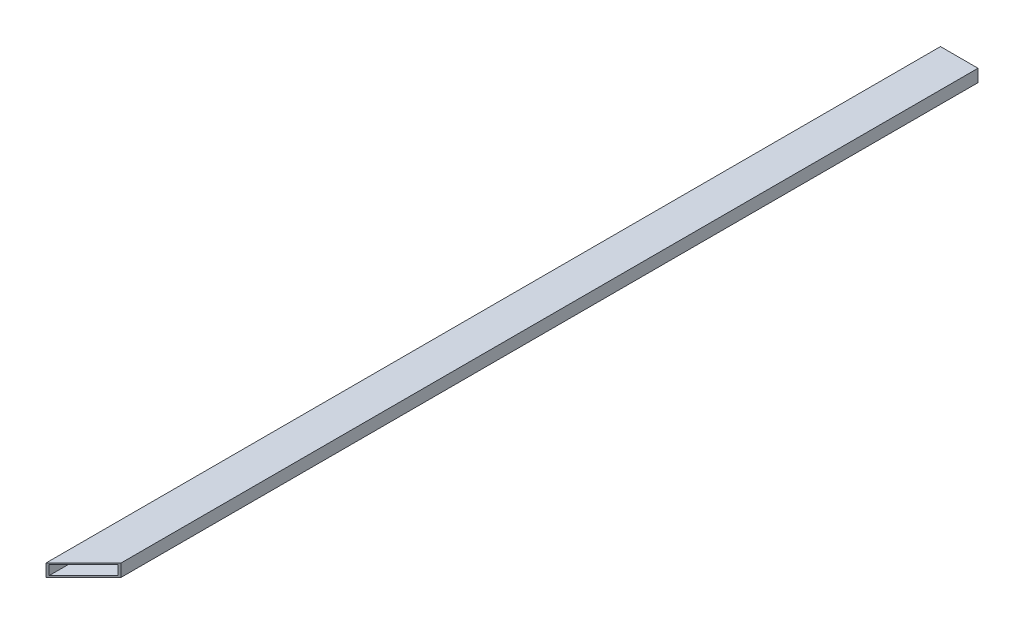
ISO-10303-21;
HEADER;
FILE_DESCRIPTION(('STEP AP214'),'2;1');
FILE_NAME('part.step','',(''),(''),'','','');
FILE_SCHEMA(('AUTOMOTIVE_DESIGN { 1 0 10303 214 1 1 1 1 }'));
ENDSEC;
DATA;
#1=APPLICATION_CONTEXT('core data for automotive mechanical design processes');
#2=APPLICATION_PROTOCOL_DEFINITION('international standard','automotive_design',2000,#1);
#3=PRODUCT_CONTEXT('',#1,'mechanical');
#4=PRODUCT('Part','Part','',(#3));
#5=PRODUCT_RELATED_PRODUCT_CATEGORY('part','',(#4));
#6=PRODUCT_DEFINITION_FORMATION('','',#4);
#7=PRODUCT_DEFINITION_CONTEXT('part definition',#1,'design');
#8=PRODUCT_DEFINITION('design','',#6,#7);
#9=PRODUCT_DEFINITION_SHAPE('','',#8);
#10=(LENGTH_UNIT() NAMED_UNIT(*) SI_UNIT(.MILLI.,.METRE.));
#11=(NAMED_UNIT(*) PLANE_ANGLE_UNIT() SI_UNIT($,.RADIAN.));
#12=(NAMED_UNIT(*) SI_UNIT($,.STERADIAN.) SOLID_ANGLE_UNIT());
#13=UNCERTAINTY_MEASURE_WITH_UNIT(LENGTH_MEASURE(1.E-05),#10,'distance_accuracy_value','');
#14=(GEOMETRIC_REPRESENTATION_CONTEXT(3) GLOBAL_UNCERTAINTY_ASSIGNED_CONTEXT((#13)) GLOBAL_UNIT_ASSIGNED_CONTEXT((#10,
#11,#12)) REPRESENTATION_CONTEXT('',''));
#15=CARTESIAN_POINT('',(0.,0.,0.));
#16=DIRECTION('',(0.,0.,1.));
#17=DIRECTION('',(1.,0.,0.));
#18=AXIS2_PLACEMENT_3D('',#15,#16,#17);
#19=CARTESIAN_POINT('',(38.1,12.7,-908.05));
#20=DIRECTION('',(0.,1.,0.));
#21=DIRECTION('',(0.,0.,1.));
#22=AXIS2_PLACEMENT_3D('',#19,#20,#21);
#23=PLANE('',#22);
#24=DIRECTION('',(0.,0.,1.));
#25=VECTOR('',#24,1.);
#26=CARTESIAN_POINT('',(-38.1,12.7,-908.05));
#27=LINE('',#26,#25);
#28=CARTESIAN_POINT('',(-38.0999999999999,12.7,908.05));
#29=VERTEX_POINT('',#28);
#30=CARTESIAN_POINT('',(-38.1,12.7,-908.05));
#31=VERTEX_POINT('',#30);
#32=EDGE_CURVE('E89',#29,#31,#27,.F.);
#33=ORIENTED_EDGE('',*,*,#32,.F.);
#34=DIRECTION('',(0.707106781186548,0.,-0.707106781186548));
#35=VECTOR('',#34,1.);
#36=CARTESIAN_POINT('',(0.,12.7,869.95));
#37=LINE('',#36,#35);
#38=CARTESIAN_POINT('',(38.1,12.7,831.85));
#39=VERTEX_POINT('',#38);
#40=EDGE_CURVE('E131',#39,#29,#37,.F.);
#41=ORIENTED_EDGE('',*,*,#40,.F.);
#42=DIRECTION('',(0.,0.,-1.));
#43=VECTOR('',#42,1.);
#44=CARTESIAN_POINT('',(38.1,12.7,-908.05));
#45=LINE('',#44,#43);
#46=CARTESIAN_POINT('',(38.1,12.7,-908.05));
#47=VERTEX_POINT('',#46);
#48=EDGE_CURVE('E141',#47,#39,#45,.F.);
#49=ORIENTED_EDGE('',*,*,#48,.F.);
#50=DIRECTION('',(1.,0.,0.));
#51=VECTOR('',#50,1.);
#52=CARTESIAN_POINT('',(0.,12.7,-908.05));
#53=LINE('',#52,#51);
#54=EDGE_CURVE('E98',#47,#31,#53,.F.);
#55=ORIENTED_EDGE('',*,*,#54,.T.);
#56=EDGE_LOOP('',(#33,#41,#49,#55));
#57=FACE_BOUND('',#56,.T.);
#58=ADVANCED_FACE('F17',(#57),#23,.T.);
#59=CARTESIAN_POINT('',(35.052,9.652,-908.05));
#60=DIRECTION('',(-1.,0.,0.));
#61=DIRECTION('',(0.,0.,1.));
#62=AXIS2_PLACEMENT_3D('',#59,#60,#61);
#63=PLANE('',#62);
#64=DIRECTION('',(0.,0.,1.));
#65=VECTOR('',#64,1.);
#66=CARTESIAN_POINT('',(35.052,-9.652,-908.05));
#67=LINE('',#66,#65);
#68=CARTESIAN_POINT('',(35.052,-9.652,834.898));
#69=VERTEX_POINT('',#68);
#70=CARTESIAN_POINT('',(35.052,-9.652,-908.05));
#71=VERTEX_POINT('',#70);
#72=EDGE_CURVE('E20',#69,#71,#67,.F.);
#73=ORIENTED_EDGE('',*,*,#72,.F.);
#74=DIRECTION('',(0.,1.,0.));
#75=VECTOR('',#74,1.);
#76=CARTESIAN_POINT('',(35.0520000000001,-5.4143356464912E-13,834.898));
#77=LINE('',#76,#75);
#78=CARTESIAN_POINT('',(35.052,9.652,834.898));
#79=VERTEX_POINT('',#78);
#80=EDGE_CURVE('E85',#79,#69,#77,.F.);
#81=ORIENTED_EDGE('',*,*,#80,.F.);
#82=DIRECTION('',(0.,0.,-1.));
#83=VECTOR('',#82,1.);
#84=CARTESIAN_POINT('',(35.052,9.652,-908.05));
#85=LINE('',#84,#83);
#86=CARTESIAN_POINT('',(35.052,9.652,-908.05));
#87=VERTEX_POINT('',#86);
#88=EDGE_CURVE('E78',#87,#79,#85,.F.);
#89=ORIENTED_EDGE('',*,*,#88,.F.);
#90=DIRECTION('',(0.,1.,0.));
#91=VECTOR('',#90,1.);
#92=CARTESIAN_POINT('',(35.052,0.,-908.05));
#93=LINE('',#92,#91);
#94=EDGE_CURVE('E82',#87,#71,#93,.F.);
#95=ORIENTED_EDGE('',*,*,#94,.T.);
#96=EDGE_LOOP('',(#73,#81,#89,#95));
#97=FACE_BOUND('',#96,.T.);
#98=ADVANCED_FACE('F80',(#97),#63,.T.);
#99=CARTESIAN_POINT('',(35.052,-9.652,-908.05));
#100=DIRECTION('',(0.,1.,0.));
#101=DIRECTION('',(0.,0.,1.));
#102=AXIS2_PLACEMENT_3D('',#99,#100,#101);
#103=PLANE('',#102);
#104=DIRECTION('',(0.,0.,-1.));
#105=VECTOR('',#104,1.);
#106=CARTESIAN_POINT('',(-35.052,-9.652,-908.05));
#107=LINE('',#106,#105);
#108=CARTESIAN_POINT('',(-35.052,-9.652,905.002));
#109=VERTEX_POINT('',#108);
#110=CARTESIAN_POINT('',(-35.052,-9.652,-908.05));
#111=VERTEX_POINT('',#110);
#112=EDGE_CURVE('E115',#109,#111,#107,.T.);
#113=ORIENTED_EDGE('',*,*,#112,.F.);
#114=DIRECTION('',(0.707106781186548,0.,-0.707106781186548));
#115=VECTOR('',#114,1.);
#116=CARTESIAN_POINT('',(0.,-9.652,869.95));
#117=LINE('',#116,#115);
#118=EDGE_CURVE('E123',#69,#109,#117,.F.);
#119=ORIENTED_EDGE('',*,*,#118,.F.);
#120=ORIENTED_EDGE('',*,*,#72,.T.);
#121=DIRECTION('',(1.,0.,0.));
#122=VECTOR('',#121,1.);
#123=CARTESIAN_POINT('',(0.,-9.652,-908.05));
#124=LINE('',#123,#122);
#125=EDGE_CURVE('E103',#71,#111,#124,.F.);
#126=ORIENTED_EDGE('',*,*,#125,.T.);
#127=EDGE_LOOP('',(#113,#119,#120,#126));
#128=FACE_BOUND('',#127,.T.);
#129=ADVANCED_FACE('F121',(#128),#103,.T.);
#130=CARTESIAN_POINT('',(-35.052,-9.652,-908.05));
#131=DIRECTION('',(1.,0.,0.));
#132=DIRECTION('',(0.,0.,-1.));
#133=AXIS2_PLACEMENT_3D('',#130,#131,#132);
#134=PLANE('',#133);
#135=DIRECTION('',(0.,0.,-1.));
#136=VECTOR('',#135,1.);
#137=CARTESIAN_POINT('',(-35.052,9.652,-908.05));
#138=LINE('',#137,#136);
#139=CARTESIAN_POINT('',(-35.052,9.652,905.002));
#140=VERTEX_POINT('',#139);
#141=CARTESIAN_POINT('',(-35.052,9.652,-908.05));
#142=VERTEX_POINT('',#141);
#143=EDGE_CURVE('E90',#140,#142,#138,.T.);
#144=ORIENTED_EDGE('',*,*,#143,.F.);
#145=DIRECTION('',(0.,1.,0.));
#146=VECTOR('',#145,1.);
#147=CARTESIAN_POINT('',(-35.052,-5.4143356464912E-13,905.002));
#148=LINE('',#147,#146);
#149=EDGE_CURVE('E126',#109,#140,#148,.T.);
#150=ORIENTED_EDGE('',*,*,#149,.F.);
#151=ORIENTED_EDGE('',*,*,#112,.T.);
#152=DIRECTION('',(0.,1.,0.));
#153=VECTOR('',#152,1.);
#154=CARTESIAN_POINT('',(-35.052,0.,-908.05));
#155=LINE('',#154,#153);
#156=EDGE_CURVE('E105',#111,#142,#155,.T.);
#157=ORIENTED_EDGE('',*,*,#156,.T.);
#158=EDGE_LOOP('',(#144,#150,#151,#157));
#159=FACE_BOUND('',#158,.T.);
#160=ADVANCED_FACE('F145',(#159),#134,.T.);
#161=CARTESIAN_POINT('',(-35.052,9.652,-908.05));
#162=DIRECTION('',(0.,-1.,0.));
#163=DIRECTION('',(0.,0.,-1.));
#164=AXIS2_PLACEMENT_3D('',#161,#162,#163);
#165=PLANE('',#164);
#166=ORIENTED_EDGE('',*,*,#88,.T.);
#167=DIRECTION('',(0.707106781186548,0.,-0.707106781186548));
#168=VECTOR('',#167,1.);
#169=CARTESIAN_POINT('',(0.,9.652,869.95));
#170=LINE('',#169,#168);
#171=EDGE_CURVE('E130',#140,#79,#170,.T.);
#172=ORIENTED_EDGE('',*,*,#171,.F.);
#173=ORIENTED_EDGE('',*,*,#143,.T.);
#174=DIRECTION('',(1.,0.,0.));
#175=VECTOR('',#174,1.);
#176=CARTESIAN_POINT('',(0.,9.652,-908.05));
#177=LINE('',#176,#175);
#178=EDGE_CURVE('E93',#142,#87,#177,.T.);
#179=ORIENTED_EDGE('',*,*,#178,.T.);
#180=EDGE_LOOP('',(#166,#172,#173,#179));
#181=FACE_BOUND('',#180,.T.);
#182=ADVANCED_FACE('F94',(#181),#165,.T.);
#183=CARTESIAN_POINT('',(-38.1,12.7,-908.05));
#184=DIRECTION('',(-1.,0.,0.));
#185=DIRECTION('',(0.,0.,1.));
#186=AXIS2_PLACEMENT_3D('',#183,#184,#185);
#187=PLANE('',#186);
#188=DIRECTION('',(0.,0.,-1.));
#189=VECTOR('',#188,1.);
#190=CARTESIAN_POINT('',(-38.1,-12.7,-908.05));
#191=LINE('',#190,#189);
#192=CARTESIAN_POINT('',(-38.0999999999999,-12.7,908.05));
#193=VERTEX_POINT('',#192);
#194=CARTESIAN_POINT('',(-38.1,-12.7,-908.05));
#195=VERTEX_POINT('',#194);
#196=EDGE_CURVE('E146',#193,#195,#191,.T.);
#197=ORIENTED_EDGE('',*,*,#196,.F.);
#198=DIRECTION('',(0.,1.,0.));
#199=VECTOR('',#198,1.);
#200=CARTESIAN_POINT('',(-38.0999999999999,-5.4143356464912E-13,908.05));
#201=LINE('',#200,#199);
#202=EDGE_CURVE('E138',#29,#193,#201,.F.);
#203=ORIENTED_EDGE('',*,*,#202,.F.);
#204=ORIENTED_EDGE('',*,*,#32,.T.);
#205=DIRECTION('',(0.,1.,0.));
#206=VECTOR('',#205,1.);
#207=CARTESIAN_POINT('',(-38.1,0.,-908.05));
#208=LINE('',#207,#206);
#209=EDGE_CURVE('E111',#31,#195,#208,.F.);
#210=ORIENTED_EDGE('',*,*,#209,.T.);
#211=EDGE_LOOP('',(#197,#203,#204,#210));
#212=FACE_BOUND('',#211,.T.);
#213=ADVANCED_FACE('F165',(#212),#187,.T.);
#214=CARTESIAN_POINT('',(0.,0.,-908.05));
#215=DIRECTION('',(0.,0.,1.));
#216=DIRECTION('',(1.,0.,0.));
#217=AXIS2_PLACEMENT_3D('',#214,#215,#216);
#218=PLANE('',#217);
#219=ORIENTED_EDGE('',*,*,#125,.F.);
#220=ORIENTED_EDGE('',*,*,#94,.F.);
#221=ORIENTED_EDGE('',*,*,#178,.F.);
#222=ORIENTED_EDGE('',*,*,#156,.F.);
#223=EDGE_LOOP('',(#219,#220,#221,#222));
#224=FACE_BOUND('',#223,.T.);
#225=DIRECTION('',(0.,1.,0.));
#226=VECTOR('',#225,1.);
#227=CARTESIAN_POINT('',(38.1,-12.7,-908.05));
#228=LINE('',#227,#226);
#229=CARTESIAN_POINT('',(38.1,-12.7,-908.05));
#230=VERTEX_POINT('',#229);
#231=EDGE_CURVE('E143',#230,#47,#228,.T.);
#232=ORIENTED_EDGE('',*,*,#231,.F.);
#233=DIRECTION('',(1.,0.,0.));
#234=VECTOR('',#233,1.);
#235=CARTESIAN_POINT('',(-38.1,-12.7,-908.05));
#236=LINE('',#235,#234);
#237=EDGE_CURVE('E151',#195,#230,#236,.T.);
#238=ORIENTED_EDGE('',*,*,#237,.F.);
#239=ORIENTED_EDGE('',*,*,#209,.F.);
#240=ORIENTED_EDGE('',*,*,#54,.F.);
#241=EDGE_LOOP('',(#232,#238,#239,#240));
#242=FACE_BOUND('',#241,.T.);
#243=ADVANCED_FACE('F101',(#224,#242),#218,.F.);
#244=CARTESIAN_POINT('',(38.1,-12.7,-908.05));
#245=DIRECTION('',(1.,0.,0.));
#246=DIRECTION('',(0.,0.,-1.));
#247=AXIS2_PLACEMENT_3D('',#244,#245,#246);
#248=PLANE('',#247);
#249=ORIENTED_EDGE('',*,*,#48,.T.);
#250=DIRECTION('',(0.,1.,0.));
#251=VECTOR('',#250,1.);
#252=CARTESIAN_POINT('',(38.1,-5.4143356464912E-13,831.85));
#253=LINE('',#252,#251);
#254=CARTESIAN_POINT('',(38.1,-12.7,831.85));
#255=VERTEX_POINT('',#254);
#256=EDGE_CURVE('E35',#255,#39,#253,.T.);
#257=ORIENTED_EDGE('',*,*,#256,.F.);
#258=DIRECTION('',(0.,0.,-1.));
#259=VECTOR('',#258,1.);
#260=CARTESIAN_POINT('',(38.1,-12.7,-908.05));
#261=LINE('',#260,#259);
#262=EDGE_CURVE('E26',#230,#255,#261,.F.);
#263=ORIENTED_EDGE('',*,*,#262,.F.);
#264=ORIENTED_EDGE('',*,*,#231,.T.);
#265=EDGE_LOOP('',(#249,#257,#263,#264));
#266=FACE_BOUND('',#265,.T.);
#267=ADVANCED_FACE('F158',(#266),#248,.T.);
#268=CARTESIAN_POINT('',(0.,-5.4143356464912E-13,869.95));
#269=DIRECTION('',(0.707106781186548,0.,0.707106781186548));
#270=DIRECTION('',(0.707106781186548,0.,-0.707106781186548));
#271=AXIS2_PLACEMENT_3D('',#268,#269,#270);
#272=PLANE('',#271);
#273=ORIENTED_EDGE('',*,*,#149,.T.);
#274=ORIENTED_EDGE('',*,*,#171,.T.);
#275=ORIENTED_EDGE('',*,*,#80,.T.);
#276=ORIENTED_EDGE('',*,*,#118,.T.);
#277=EDGE_LOOP('',(#273,#274,#275,#276));
#278=FACE_BOUND('',#277,.T.);
#279=ORIENTED_EDGE('',*,*,#256,.T.);
#280=ORIENTED_EDGE('',*,*,#40,.T.);
#281=ORIENTED_EDGE('',*,*,#202,.T.);
#282=DIRECTION('',(-0.707106781186548,0.,0.707106781186547));
#283=VECTOR('',#282,1.);
#284=CARTESIAN_POINT('',(38.1,-12.7,831.85));
#285=LINE('',#284,#283);
#286=EDGE_CURVE('E11',#255,#193,#285,.T.);
#287=ORIENTED_EDGE('',*,*,#286,.F.);
#288=EDGE_LOOP('',(#279,#280,#281,#287));
#289=FACE_BOUND('',#288,.T.);
#290=ADVANCED_FACE('F128',(#278,#289),#272,.T.);
#291=CARTESIAN_POINT('',(-38.1,-12.7,-908.05));
#292=DIRECTION('',(0.,-1.,0.));
#293=DIRECTION('',(0.,0.,-1.));
#294=AXIS2_PLACEMENT_3D('',#291,#292,#293);
#295=PLANE('',#294);
#296=ORIENTED_EDGE('',*,*,#262,.T.);
#297=ORIENTED_EDGE('',*,*,#286,.T.);
#298=ORIENTED_EDGE('',*,*,#196,.T.);
#299=ORIENTED_EDGE('',*,*,#237,.T.);
#300=EDGE_LOOP('',(#296,#297,#298,#299));
#301=FACE_BOUND('',#300,.T.);
#302=ADVANCED_FACE('F156',(#301),#295,.T.);
#303=CLOSED_SHELL('',(#58,#98,#129,#160,#182,#213,#243,#267,#290,#302));
#304=MANIFOLD_SOLID_BREP('B1',#303);
#305=ADVANCED_BREP_SHAPE_REPRESENTATION('',(#18,#304),#14);
#306=SHAPE_DEFINITION_REPRESENTATION(#9,#305);
ENDSEC;
END-ISO-10303-21;
